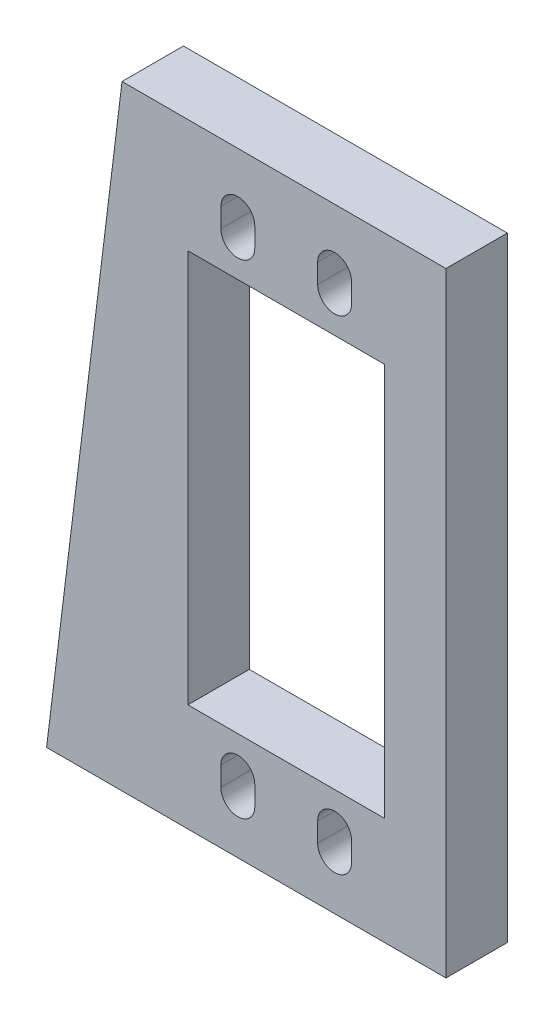
ISO-10303-21;
HEADER;
FILE_DESCRIPTION(('STEP AP214'),'2;1');
FILE_NAME('part.step','',(''),(''),'','','');
FILE_SCHEMA(('AUTOMOTIVE_DESIGN { 1 0 10303 214 1 1 1 1 }'));
ENDSEC;
DATA;
#1=APPLICATION_CONTEXT('core data for automotive mechanical design processes');
#2=APPLICATION_PROTOCOL_DEFINITION('international standard','automotive_design',2000,#1);
#3=PRODUCT_CONTEXT('',#1,'mechanical');
#4=PRODUCT('Part','Part','',(#3));
#5=PRODUCT_RELATED_PRODUCT_CATEGORY('part','',(#4));
#6=PRODUCT_DEFINITION_FORMATION('','',#4);
#7=PRODUCT_DEFINITION_CONTEXT('part definition',#1,'design');
#8=PRODUCT_DEFINITION('design','',#6,#7);
#9=PRODUCT_DEFINITION_SHAPE('','',#8);
#10=(LENGTH_UNIT() NAMED_UNIT(*) SI_UNIT(.MILLI.,.METRE.));
#11=(NAMED_UNIT(*) PLANE_ANGLE_UNIT() SI_UNIT($,.RADIAN.));
#12=(NAMED_UNIT(*) SI_UNIT($,.STERADIAN.) SOLID_ANGLE_UNIT());
#13=UNCERTAINTY_MEASURE_WITH_UNIT(LENGTH_MEASURE(1.E-05),#10,'distance_accuracy_value','');
#14=(GEOMETRIC_REPRESENTATION_CONTEXT(3) GLOBAL_UNCERTAINTY_ASSIGNED_CONTEXT((#13)) GLOBAL_UNIT_ASSIGNED_CONTEXT((#10,
#11,#12)) REPRESENTATION_CONTEXT('',''));
#15=CARTESIAN_POINT('',(0.,0.,0.));
#16=DIRECTION('',(0.,0.,1.));
#17=DIRECTION('',(1.,0.,0.));
#18=AXIS2_PLACEMENT_3D('',#15,#16,#17);
#19=CARTESIAN_POINT('',(34.9250000000002,1.31188462870747E-13,6.35));
#20=DIRECTION('',(1.,0.,0.));
#21=DIRECTION('',(0.,1.,0.));
#22=AXIS2_PLACEMENT_3D('',#19,#20,#21);
#23=PLANE('',#22);
#24=DIRECTION('',(0.,-1.,0.));
#25=VECTOR('',#24,1.);
#26=CARTESIAN_POINT('',(34.9250000000002,1.31188462870747E-13,0.));
#27=LINE('',#26,#25);
#28=CARTESIAN_POINT('',(34.925,51.7525,0.));
#29=VERTEX_POINT('',#28);
#30=CARTESIAN_POINT('',(34.9250000000002,11.1125,0.));
#31=VERTEX_POINT('',#30);
#32=EDGE_CURVE('E289',#29,#31,#27,.T.);
#33=ORIENTED_EDGE('',*,*,#32,.T.);
#34=DIRECTION('',(0.,0.,-1.));
#35=VECTOR('',#34,1.);
#36=CARTESIAN_POINT('',(34.9250000000002,11.1125,6.35));
#37=LINE('',#36,#35);
#38=CARTESIAN_POINT('',(34.9250000000002,11.1125,6.35));
#39=VERTEX_POINT('',#38);
#40=EDGE_CURVE('E11',#39,#31,#37,.T.);
#41=ORIENTED_EDGE('',*,*,#40,.F.);
#42=DIRECTION('',(0.,-1.,0.));
#43=VECTOR('',#42,1.);
#44=CARTESIAN_POINT('',(34.9250000000002,1.31188462870747E-13,6.35));
#45=LINE('',#44,#43);
#46=CARTESIAN_POINT('',(34.925,51.7525,6.35));
#47=VERTEX_POINT('',#46);
#48=EDGE_CURVE('E212',#47,#39,#45,.T.);
#49=ORIENTED_EDGE('',*,*,#48,.F.);
#50=DIRECTION('',(0.,0.,-1.));
#51=VECTOR('',#50,1.);
#52=CARTESIAN_POINT('',(34.925,51.7525,6.35));
#53=LINE('',#52,#51);
#54=EDGE_CURVE('E56',#47,#29,#53,.T.);
#55=ORIENTED_EDGE('',*,*,#54,.T.);
#56=EDGE_LOOP('',(#33,#41,#49,#55));
#57=FACE_BOUND('',#56,.T.);
#58=ADVANCED_FACE('F37',(#57),#23,.F.);
#59=CARTESIAN_POINT('',(0.,11.1124999999999,6.35));
#60=DIRECTION('',(0.,-1.,0.));
#61=DIRECTION('',(1.,0.,0.));
#62=AXIS2_PLACEMENT_3D('',#59,#60,#61);
#63=PLANE('',#62);
#64=DIRECTION('',(-1.,0.,0.));
#65=VECTOR('',#64,1.);
#66=CARTESIAN_POINT('',(0.,11.1124999999999,0.));
#67=LINE('',#66,#65);
#68=CARTESIAN_POINT('',(14.6050000000002,11.1124999999999,0.));
#69=VERTEX_POINT('',#68);
#70=EDGE_CURVE('E218',#31,#69,#67,.T.);
#71=ORIENTED_EDGE('',*,*,#70,.T.);
#72=DIRECTION('',(0.,0.,-1.));
#73=VECTOR('',#72,1.);
#74=CARTESIAN_POINT('',(14.6050000000002,11.1124999999999,6.35));
#75=LINE('',#74,#73);
#76=CARTESIAN_POINT('',(14.6050000000002,11.1124999999999,6.35));
#77=VERTEX_POINT('',#76);
#78=EDGE_CURVE('E47',#77,#69,#75,.T.);
#79=ORIENTED_EDGE('',*,*,#78,.F.);
#80=DIRECTION('',(-1.,0.,0.));
#81=VECTOR('',#80,1.);
#82=CARTESIAN_POINT('',(0.,11.1124999999999,6.35));
#83=LINE('',#82,#81);
#84=EDGE_CURVE('E206',#39,#77,#83,.T.);
#85=ORIENTED_EDGE('',*,*,#84,.F.);
#86=ORIENTED_EDGE('',*,*,#40,.T.);
#87=EDGE_LOOP('',(#71,#79,#85,#86));
#88=FACE_BOUND('',#87,.T.);
#89=ADVANCED_FACE('F217',(#88),#63,.F.);
#90=CARTESIAN_POINT('',(14.6050000000002,0.,6.35));
#91=DIRECTION('',(1.,0.,0.));
#92=DIRECTION('',(0.,1.,0.));
#93=AXIS2_PLACEMENT_3D('',#90,#91,#92);
#94=PLANE('',#93);
#95=DIRECTION('',(0.,-1.,0.));
#96=VECTOR('',#95,1.);
#97=CARTESIAN_POINT('',(14.6050000000002,0.,0.));
#98=LINE('',#97,#96);
#99=CARTESIAN_POINT('',(14.605,51.7524999999999,0.));
#100=VERTEX_POINT('',#99);
#101=EDGE_CURVE('E292',#100,#69,#98,.T.);
#102=ORIENTED_EDGE('',*,*,#101,.F.);
#103=DIRECTION('',(0.,0.,-1.));
#104=VECTOR('',#103,1.);
#105=CARTESIAN_POINT('',(14.605,51.7524999999999,6.35));
#106=LINE('',#105,#104);
#107=CARTESIAN_POINT('',(14.605,51.7524999999999,6.35));
#108=VERTEX_POINT('',#107);
#109=EDGE_CURVE('E130',#108,#100,#106,.T.);
#110=ORIENTED_EDGE('',*,*,#109,.F.);
#111=DIRECTION('',(0.,-1.,0.));
#112=VECTOR('',#111,1.);
#113=CARTESIAN_POINT('',(14.6050000000002,0.,6.35));
#114=LINE('',#113,#112);
#115=EDGE_CURVE('E211',#108,#77,#114,.T.);
#116=ORIENTED_EDGE('',*,*,#115,.T.);
#117=ORIENTED_EDGE('',*,*,#78,.T.);
#118=EDGE_LOOP('',(#102,#110,#116,#117));
#119=FACE_BOUND('',#118,.T.);
#120=ADVANCED_FACE('F222',(#119),#94,.T.);
#121=CARTESIAN_POINT('',(0.,0.,6.35));
#122=DIRECTION('',(0.,1.,0.));
#123=DIRECTION('',(0.,0.,1.));
#124=AXIS2_PLACEMENT_3D('',#121,#122,#123);
#125=PLANE('',#124);
#126=DIRECTION('',(1.,0.,0.));
#127=VECTOR('',#126,1.);
#128=CARTESIAN_POINT('',(0.,0.,0.));
#129=LINE('',#128,#127);
#130=CARTESIAN_POINT('',(0.,0.,0.));
#131=VERTEX_POINT('',#130);
#132=CARTESIAN_POINT('',(41.275,0.,0.));
#133=VERTEX_POINT('',#132);
#134=EDGE_CURVE('E277',#131,#133,#129,.T.);
#135=ORIENTED_EDGE('',*,*,#134,.T.);
#136=DIRECTION('',(0.,0.,-1.));
#137=VECTOR('',#136,1.);
#138=CARTESIAN_POINT('',(41.275,0.,6.35));
#139=LINE('',#138,#137);
#140=CARTESIAN_POINT('',(41.275,0.,6.35));
#141=VERTEX_POINT('',#140);
#142=EDGE_CURVE('E299',#141,#133,#139,.T.);
#143=ORIENTED_EDGE('',*,*,#142,.F.);
#144=DIRECTION('',(1.,0.,0.));
#145=VECTOR('',#144,1.);
#146=CARTESIAN_POINT('',(0.,0.,6.35));
#147=LINE('',#146,#145);
#148=CARTESIAN_POINT('',(0.,0.,6.35));
#149=VERTEX_POINT('',#148);
#150=EDGE_CURVE('E397',#149,#141,#147,.T.);
#151=ORIENTED_EDGE('',*,*,#150,.F.);
#152=DIRECTION('',(0.,0.,-1.));
#153=VECTOR('',#152,1.);
#154=CARTESIAN_POINT('',(0.,0.,6.35));
#155=LINE('',#154,#153);
#156=EDGE_CURVE('E301',#149,#131,#155,.T.);
#157=ORIENTED_EDGE('',*,*,#156,.T.);
#158=EDGE_LOOP('',(#135,#143,#151,#157));
#159=FACE_BOUND('',#158,.T.);
#160=ADVANCED_FACE('F423',(#159),#125,.F.);
#161=CARTESIAN_POINT('',(41.275,0.,6.35));
#162=DIRECTION('',(-1.,0.,0.));
#163=DIRECTION('',(0.,0.,1.));
#164=AXIS2_PLACEMENT_3D('',#161,#162,#163);
#165=PLANE('',#164);
#166=DIRECTION('',(0.,1.,0.));
#167=VECTOR('',#166,1.);
#168=CARTESIAN_POINT('',(41.275,0.,0.));
#169=LINE('',#168,#167);
#170=CARTESIAN_POINT('',(41.275,63.5,0.));
#171=VERTEX_POINT('',#170);
#172=EDGE_CURVE('E280',#133,#171,#169,.T.);
#173=ORIENTED_EDGE('',*,*,#172,.T.);
#174=DIRECTION('',(0.,0.,-1.));
#175=VECTOR('',#174,1.);
#176=CARTESIAN_POINT('',(41.275,63.5,6.35));
#177=LINE('',#176,#175);
#178=CARTESIAN_POINT('',(41.275,63.5,6.35));
#179=VERTEX_POINT('',#178);
#180=EDGE_CURVE('E306',#179,#171,#177,.T.);
#181=ORIENTED_EDGE('',*,*,#180,.F.);
#182=DIRECTION('',(0.,1.,0.));
#183=VECTOR('',#182,1.);
#184=CARTESIAN_POINT('',(41.275,0.,6.35));
#185=LINE('',#184,#183);
#186=EDGE_CURVE('E400',#141,#179,#185,.T.);
#187=ORIENTED_EDGE('',*,*,#186,.F.);
#188=ORIENTED_EDGE('',*,*,#142,.T.);
#189=EDGE_LOOP('',(#173,#181,#187,#188));
#190=FACE_BOUND('',#189,.T.);
#191=ADVANCED_FACE('F425',(#190),#165,.F.);
#192=CARTESIAN_POINT('',(0.,63.5,6.35));
#193=DIRECTION('',(0.,1.,0.));
#194=DIRECTION('',(0.,0.,1.));
#195=AXIS2_PLACEMENT_3D('',#192,#193,#194);
#196=PLANE('',#195);
#197=DIRECTION('',(1.,0.,0.));
#198=VECTOR('',#197,1.);
#199=CARTESIAN_POINT('',(0.,63.5,0.));
#200=LINE('',#199,#198);
#201=CARTESIAN_POINT('',(7.79681961733423,63.5,0.));
#202=VERTEX_POINT('',#201);
#203=EDGE_CURVE('E283',#202,#171,#200,.T.);
#204=ORIENTED_EDGE('',*,*,#203,.F.);
#205=DIRECTION('',(0.,0.,-1.));
#206=VECTOR('',#205,1.);
#207=CARTESIAN_POINT('',(7.79681961733423,63.5,6.35));
#208=LINE('',#207,#206);
#209=CARTESIAN_POINT('',(7.79681961733423,63.5,6.35));
#210=VERTEX_POINT('',#209);
#211=EDGE_CURVE('E303',#210,#202,#208,.T.);
#212=ORIENTED_EDGE('',*,*,#211,.F.);
#213=DIRECTION('',(1.,0.,0.));
#214=VECTOR('',#213,1.);
#215=CARTESIAN_POINT('',(0.,63.5,6.35));
#216=LINE('',#215,#214);
#217=EDGE_CURVE('E402',#210,#179,#216,.T.);
#218=ORIENTED_EDGE('',*,*,#217,.T.);
#219=ORIENTED_EDGE('',*,*,#180,.T.);
#220=EDGE_LOOP('',(#204,#212,#218,#219));
#221=FACE_BOUND('',#220,.T.);
#222=ADVANCED_FACE('F418',(#221),#196,.T.);
#223=CARTESIAN_POINT('',(19.765,57.4324999999999,6.35));
#224=DIRECTION('',(0.,0.,-1.));
#225=DIRECTION('',(-1.,0.,0.));
#226=AXIS2_PLACEMENT_3D('',#223,#224,#225);
#227=CYLINDRICAL_SURFACE('',#226,1.75000000000001);
#228=CARTESIAN_POINT('',(19.765,57.4324999999999,0.));
#229=DIRECTION('',(0.,0.,1.));
#230=DIRECTION('',(1.,0.,0.));
#231=AXIS2_PLACEMENT_3D('',#228,#229,#230);
#232=CIRCLE('',#231,1.75000000000001);
#233=CARTESIAN_POINT('',(21.515,57.4324999999999,0.));
#234=VERTEX_POINT('',#233);
#235=CARTESIAN_POINT('',(18.015,57.4324999999999,0.));
#236=VERTEX_POINT('',#235);
#237=EDGE_CURVE('E265',#234,#236,#232,.T.);
#238=ORIENTED_EDGE('',*,*,#237,.F.);
#239=DIRECTION('',(0.,0.,-1.));
#240=VECTOR('',#239,1.);
#241=CARTESIAN_POINT('',(21.515,57.4324999999999,6.35));
#242=LINE('',#241,#240);
#243=CARTESIAN_POINT('',(21.515,57.4324999999999,6.35));
#244=VERTEX_POINT('',#243);
#245=EDGE_CURVE('E304',#244,#234,#242,.T.);
#246=ORIENTED_EDGE('',*,*,#245,.F.);
#247=CARTESIAN_POINT('',(19.765,57.4324999999999,6.35));
#248=DIRECTION('',(0.,0.,1.));
#249=DIRECTION('',(1.,0.,0.));
#250=AXIS2_PLACEMENT_3D('',#247,#248,#249);
#251=CIRCLE('',#250,1.75000000000001);
#252=CARTESIAN_POINT('',(18.015,57.4324999999999,6.35));
#253=VERTEX_POINT('',#252);
#254=EDGE_CURVE('E386',#244,#253,#251,.T.);
#255=ORIENTED_EDGE('',*,*,#254,.T.);
#256=DIRECTION('',(0.,0.,-1.));
#257=VECTOR('',#256,1.);
#258=CARTESIAN_POINT('',(18.015,57.4324999999999,6.35));
#259=LINE('',#258,#257);
#260=EDGE_CURVE('E310',#253,#236,#259,.T.);
#261=ORIENTED_EDGE('',*,*,#260,.T.);
#262=EDGE_LOOP('',(#238,#246,#255,#261));
#263=FACE_BOUND('',#262,.T.);
#264=ADVANCED_FACE('F432',(#263),#227,.F.);
#265=CARTESIAN_POINT('',(21.5150000000004,1.49290302342567E-13,6.35));
#266=DIRECTION('',(-1.,0.,0.));
#267=DIRECTION('',(0.,-1.,0.));
#268=AXIS2_PLACEMENT_3D('',#265,#266,#267);
#269=PLANE('',#268);
#270=DIRECTION('',(0.,1.,0.));
#271=VECTOR('',#270,1.);
#272=CARTESIAN_POINT('',(21.5150000000004,1.49290302342567E-13,0.));
#273=LINE('',#272,#271);
#274=CARTESIAN_POINT('',(21.515,55.4324999999999,0.));
#275=VERTEX_POINT('',#274);
#276=EDGE_CURVE('E268',#275,#234,#273,.T.);
#277=ORIENTED_EDGE('',*,*,#276,.F.);
#278=DIRECTION('',(0.,0.,-1.));
#279=VECTOR('',#278,1.);
#280=CARTESIAN_POINT('',(21.515,55.4324999999999,6.35));
#281=LINE('',#280,#279);
#282=CARTESIAN_POINT('',(21.515,55.4324999999999,6.35));
#283=VERTEX_POINT('',#282);
#284=EDGE_CURVE('E315',#283,#275,#281,.T.);
#285=ORIENTED_EDGE('',*,*,#284,.F.);
#286=DIRECTION('',(0.,1.,0.));
#287=VECTOR('',#286,1.);
#288=CARTESIAN_POINT('',(21.5150000000004,1.49290302342567E-13,6.35));
#289=LINE('',#288,#287);
#290=EDGE_CURVE('E389',#283,#244,#289,.T.);
#291=ORIENTED_EDGE('',*,*,#290,.T.);
#292=ORIENTED_EDGE('',*,*,#245,.T.);
#293=EDGE_LOOP('',(#277,#285,#291,#292));
#294=FACE_BOUND('',#293,.T.);
#295=ADVANCED_FACE('F494',(#294),#269,.T.);
#296=CARTESIAN_POINT('',(19.765,55.4324999999999,6.35));
#297=DIRECTION('',(0.,0.,-1.));
#298=DIRECTION('',(-1.,0.,0.));
#299=AXIS2_PLACEMENT_3D('',#296,#297,#298);
#300=CYLINDRICAL_SURFACE('',#299,1.75000000000001);
#301=CARTESIAN_POINT('',(19.765,55.4324999999999,0.));
#302=DIRECTION('',(0.,0.,1.));
#303=DIRECTION('',(1.,0.,0.));
#304=AXIS2_PLACEMENT_3D('',#301,#302,#303);
#305=CIRCLE('',#304,1.75000000000001);
#306=CARTESIAN_POINT('',(18.015,55.4324999999999,0.));
#307=VERTEX_POINT('',#306);
#308=EDGE_CURVE('E271',#307,#275,#305,.T.);
#309=ORIENTED_EDGE('',*,*,#308,.F.);
#310=DIRECTION('',(0.,0.,-1.));
#311=VECTOR('',#310,1.);
#312=CARTESIAN_POINT('',(18.015,55.4324999999999,6.35));
#313=LINE('',#312,#311);
#314=CARTESIAN_POINT('',(18.015,55.4324999999999,6.35));
#315=VERTEX_POINT('',#314);
#316=EDGE_CURVE('E312',#315,#307,#313,.T.);
#317=ORIENTED_EDGE('',*,*,#316,.F.);
#318=CARTESIAN_POINT('',(19.765,55.4324999999999,6.35));
#319=DIRECTION('',(0.,0.,1.));
#320=DIRECTION('',(1.,0.,0.));
#321=AXIS2_PLACEMENT_3D('',#318,#319,#320);
#322=CIRCLE('',#321,1.75000000000001);
#323=EDGE_CURVE('E392',#315,#283,#322,.T.);
#324=ORIENTED_EDGE('',*,*,#323,.T.);
#325=ORIENTED_EDGE('',*,*,#284,.T.);
#326=EDGE_LOOP('',(#309,#317,#324,#325));
#327=FACE_BOUND('',#326,.T.);
#328=ADVANCED_FACE('F481',(#327),#300,.F.);
#329=CARTESIAN_POINT('',(29.765,57.4324999999999,6.35));
#330=DIRECTION('',(0.,0.,-1.));
#331=DIRECTION('',(-1.,0.,0.));
#332=AXIS2_PLACEMENT_3D('',#329,#330,#331);
#333=CYLINDRICAL_SURFACE('',#332,1.75);
#334=CARTESIAN_POINT('',(29.765,57.4324999999999,0.));
#335=DIRECTION('',(0.,0.,1.));
#336=DIRECTION('',(1.,0.,0.));
#337=AXIS2_PLACEMENT_3D('',#334,#335,#336);
#338=CIRCLE('',#337,1.75);
#339=CARTESIAN_POINT('',(31.515,57.4325,0.));
#340=VERTEX_POINT('',#339);
#341=CARTESIAN_POINT('',(28.015,57.4324999999999,0.));
#342=VERTEX_POINT('',#341);
#343=EDGE_CURVE('E253',#340,#342,#338,.T.);
#344=ORIENTED_EDGE('',*,*,#343,.F.);
#345=DIRECTION('',(0.,0.,-1.));
#346=VECTOR('',#345,1.);
#347=CARTESIAN_POINT('',(31.515,57.4325,6.35));
#348=LINE('',#347,#346);
#349=CARTESIAN_POINT('',(31.515,57.4325,6.35));
#350=VERTEX_POINT('',#349);
#351=EDGE_CURVE('E313',#350,#340,#348,.T.);
#352=ORIENTED_EDGE('',*,*,#351,.F.);
#353=CARTESIAN_POINT('',(29.765,57.4324999999999,6.35));
#354=DIRECTION('',(0.,0.,1.));
#355=DIRECTION('',(1.,0.,0.));
#356=AXIS2_PLACEMENT_3D('',#353,#354,#355);
#357=CIRCLE('',#356,1.75);
#358=CARTESIAN_POINT('',(28.015,57.4324999999999,6.35));
#359=VERTEX_POINT('',#358);
#360=EDGE_CURVE('E375',#350,#359,#357,.T.);
#361=ORIENTED_EDGE('',*,*,#360,.T.);
#362=DIRECTION('',(0.,0.,-1.));
#363=VECTOR('',#362,1.);
#364=CARTESIAN_POINT('',(28.015,57.4324999999999,6.35));
#365=LINE('',#364,#363);
#366=EDGE_CURVE('E318',#359,#342,#365,.T.);
#367=ORIENTED_EDGE('',*,*,#366,.T.);
#368=EDGE_LOOP('',(#344,#352,#361,#367));
#369=FACE_BOUND('',#368,.T.);
#370=ADVANCED_FACE('F477',(#369),#333,.F.);
#371=CARTESIAN_POINT('',(31.5150000000004,2.18679241381639E-13,6.35));
#372=DIRECTION('',(-1.,0.,0.));
#373=DIRECTION('',(0.,-1.,0.));
#374=AXIS2_PLACEMENT_3D('',#371,#372,#373);
#375=PLANE('',#374);
#376=DIRECTION('',(0.,1.,0.));
#377=VECTOR('',#376,1.);
#378=CARTESIAN_POINT('',(31.5150000000004,2.18679241381639E-13,0.));
#379=LINE('',#378,#377);
#380=CARTESIAN_POINT('',(31.515,55.4325,0.));
#381=VERTEX_POINT('',#380);
#382=EDGE_CURVE('E256',#381,#340,#379,.T.);
#383=ORIENTED_EDGE('',*,*,#382,.F.);
#384=DIRECTION('',(0.,0.,-1.));
#385=VECTOR('',#384,1.);
#386=CARTESIAN_POINT('',(31.515,55.4325,6.35));
#387=LINE('',#386,#385);
#388=CARTESIAN_POINT('',(31.515,55.4325,6.35));
#389=VERTEX_POINT('',#388);
#390=EDGE_CURVE('E323',#389,#381,#387,.T.);
#391=ORIENTED_EDGE('',*,*,#390,.F.);
#392=DIRECTION('',(0.,1.,0.));
#393=VECTOR('',#392,1.);
#394=CARTESIAN_POINT('',(31.5150000000004,2.18679241381639E-13,6.35));
#395=LINE('',#394,#393);
#396=EDGE_CURVE('E378',#389,#350,#395,.T.);
#397=ORIENTED_EDGE('',*,*,#396,.T.);
#398=ORIENTED_EDGE('',*,*,#351,.T.);
#399=EDGE_LOOP('',(#383,#391,#397,#398));
#400=FACE_BOUND('',#399,.T.);
#401=ADVANCED_FACE('F480',(#400),#375,.T.);
#402=CARTESIAN_POINT('',(29.765,55.4324999999999,6.35));
#403=DIRECTION('',(0.,0.,-1.));
#404=DIRECTION('',(-1.,0.,0.));
#405=AXIS2_PLACEMENT_3D('',#402,#403,#404);
#406=CYLINDRICAL_SURFACE('',#405,1.75);
#407=CARTESIAN_POINT('',(29.765,55.4324999999999,0.));
#408=DIRECTION('',(0.,0.,1.));
#409=DIRECTION('',(1.,0.,0.));
#410=AXIS2_PLACEMENT_3D('',#407,#408,#409);
#411=CIRCLE('',#410,1.75);
#412=CARTESIAN_POINT('',(28.015,55.4324999999999,0.));
#413=VERTEX_POINT('',#412);
#414=EDGE_CURVE('E259',#413,#381,#411,.T.);
#415=ORIENTED_EDGE('',*,*,#414,.F.);
#416=DIRECTION('',(0.,0.,-1.));
#417=VECTOR('',#416,1.);
#418=CARTESIAN_POINT('',(28.015,55.4324999999999,6.35));
#419=LINE('',#418,#417);
#420=CARTESIAN_POINT('',(28.015,55.4324999999999,6.35));
#421=VERTEX_POINT('',#420);
#422=EDGE_CURVE('E320',#421,#413,#419,.T.);
#423=ORIENTED_EDGE('',*,*,#422,.F.);
#424=CARTESIAN_POINT('',(29.765,55.4324999999999,6.35));
#425=DIRECTION('',(0.,0.,1.));
#426=DIRECTION('',(1.,0.,0.));
#427=AXIS2_PLACEMENT_3D('',#424,#425,#426);
#428=CIRCLE('',#427,1.75);
#429=EDGE_CURVE('E381',#421,#389,#428,.T.);
#430=ORIENTED_EDGE('',*,*,#429,.T.);
#431=ORIENTED_EDGE('',*,*,#390,.T.);
#432=EDGE_LOOP('',(#415,#423,#430,#431));
#433=FACE_BOUND('',#432,.T.);
#434=ADVANCED_FACE('F465',(#433),#406,.F.);
#435=CARTESIAN_POINT('',(19.7650000000002,5.43249999999991,6.35));
#436=DIRECTION('',(0.,0.,-1.));
#437=DIRECTION('',(-1.,0.,0.));
#438=AXIS2_PLACEMENT_3D('',#435,#436,#437);
#439=CYLINDRICAL_SURFACE('',#438,1.74999999999999);
#440=CARTESIAN_POINT('',(19.7650000000002,5.43249999999991,0.));
#441=DIRECTION('',(0.,0.,1.));
#442=DIRECTION('',(1.,0.,0.));
#443=AXIS2_PLACEMENT_3D('',#440,#441,#442);
#444=CIRCLE('',#443,1.74999999999999);
#445=CARTESIAN_POINT('',(18.0150000000002,5.43249999999991,0.));
#446=VERTEX_POINT('',#445);
#447=CARTESIAN_POINT('',(21.5150000000002,5.43249999999992,0.));
#448=VERTEX_POINT('',#447);
#449=EDGE_CURVE('E241',#446,#448,#444,.T.);
#450=ORIENTED_EDGE('',*,*,#449,.F.);
#451=DIRECTION('',(0.,0.,-1.));
#452=VECTOR('',#451,1.);
#453=CARTESIAN_POINT('',(18.0150000000002,5.43249999999991,6.35));
#454=LINE('',#453,#452);
#455=CARTESIAN_POINT('',(18.0150000000002,5.43249999999991,6.35));
#456=VERTEX_POINT('',#455);
#457=EDGE_CURVE('E321',#456,#446,#454,.T.);
#458=ORIENTED_EDGE('',*,*,#457,.F.);
#459=CARTESIAN_POINT('',(19.7650000000002,5.43249999999991,6.35));
#460=DIRECTION('',(0.,0.,1.));
#461=DIRECTION('',(1.,0.,0.));
#462=AXIS2_PLACEMENT_3D('',#459,#460,#461);
#463=CIRCLE('',#462,1.74999999999999);
#464=CARTESIAN_POINT('',(21.5150000000002,5.43249999999992,6.35));
#465=VERTEX_POINT('',#464);
#466=EDGE_CURVE('E358',#456,#465,#463,.T.);
#467=ORIENTED_EDGE('',*,*,#466,.T.);
#468=DIRECTION('',(0.,0.,-1.));
#469=VECTOR('',#468,1.);
#470=CARTESIAN_POINT('',(21.5150000000002,5.43249999999992,6.35));
#471=LINE('',#470,#469);
#472=EDGE_CURVE('E326',#465,#448,#471,.T.);
#473=ORIENTED_EDGE('',*,*,#472,.T.);
#474=EDGE_LOOP('',(#450,#458,#467,#473));
#475=FACE_BOUND('',#474,.T.);
#476=ADVANCED_FACE('F461',(#475),#439,.F.);
#477=CARTESIAN_POINT('',(18.0150000000002,0.,6.35));
#478=DIRECTION('',(1.,0.,0.));
#479=DIRECTION('',(0.,0.,-1.));
#480=AXIS2_PLACEMENT_3D('',#477,#478,#479);
#481=PLANE('',#480);
#482=DIRECTION('',(0.,-1.,0.));
#483=VECTOR('',#482,1.);
#484=CARTESIAN_POINT('',(18.0150000000002,0.,0.));
#485=LINE('',#484,#483);
#486=CARTESIAN_POINT('',(18.0150000000002,7.43249999999991,0.));
#487=VERTEX_POINT('',#486);
#488=EDGE_CURVE('E244',#487,#446,#485,.T.);
#489=ORIENTED_EDGE('',*,*,#488,.F.);
#490=DIRECTION('',(0.,0.,-1.));
#491=VECTOR('',#490,1.);
#492=CARTESIAN_POINT('',(18.0150000000002,7.43249999999991,6.35));
#493=LINE('',#492,#491);
#494=CARTESIAN_POINT('',(18.0150000000002,7.43249999999991,6.35));
#495=VERTEX_POINT('',#494);
#496=EDGE_CURVE('E330',#495,#487,#493,.T.);
#497=ORIENTED_EDGE('',*,*,#496,.F.);
#498=DIRECTION('',(0.,-1.,0.));
#499=VECTOR('',#498,1.);
#500=CARTESIAN_POINT('',(18.0150000000002,0.,6.35));
#501=LINE('',#500,#499);
#502=EDGE_CURVE('E367',#495,#456,#501,.T.);
#503=ORIENTED_EDGE('',*,*,#502,.T.);
#504=ORIENTED_EDGE('',*,*,#457,.T.);
#505=EDGE_LOOP('',(#489,#497,#503,#504));
#506=FACE_BOUND('',#505,.T.);
#507=ADVANCED_FACE('F464',(#506),#481,.T.);
#508=CARTESIAN_POINT('',(19.7650000000002,7.43249999999991,6.35));
#509=DIRECTION('',(0.,0.,-1.));
#510=DIRECTION('',(-1.,0.,0.));
#511=AXIS2_PLACEMENT_3D('',#508,#509,#510);
#512=CYLINDRICAL_SURFACE('',#511,1.74999999999999);
#513=CARTESIAN_POINT('',(19.7650000000002,7.43249999999991,0.));
#514=DIRECTION('',(0.,0.,1.));
#515=DIRECTION('',(1.,0.,0.));
#516=AXIS2_PLACEMENT_3D('',#513,#514,#515);
#517=CIRCLE('',#516,1.74999999999999);
#518=CARTESIAN_POINT('',(21.5150000000002,7.43249999999993,0.));
#519=VERTEX_POINT('',#518);
#520=EDGE_CURVE('E247',#519,#487,#517,.T.);
#521=ORIENTED_EDGE('',*,*,#520,.F.);
#522=DIRECTION('',(0.,0.,-1.));
#523=VECTOR('',#522,1.);
#524=CARTESIAN_POINT('',(21.5150000000002,7.43249999999993,6.35));
#525=LINE('',#524,#523);
#526=CARTESIAN_POINT('',(21.5150000000002,7.43249999999993,6.35));
#527=VERTEX_POINT('',#526);
#528=EDGE_CURVE('E328',#527,#519,#525,.T.);
#529=ORIENTED_EDGE('',*,*,#528,.F.);
#530=CARTESIAN_POINT('',(19.7650000000002,7.43249999999991,6.35));
#531=DIRECTION('',(0.,0.,1.));
#532=DIRECTION('',(1.,0.,0.));
#533=AXIS2_PLACEMENT_3D('',#530,#531,#532);
#534=CIRCLE('',#533,1.74999999999999);
#535=EDGE_CURVE('E370',#527,#495,#534,.T.);
#536=ORIENTED_EDGE('',*,*,#535,.T.);
#537=ORIENTED_EDGE('',*,*,#496,.T.);
#538=EDGE_LOOP('',(#521,#529,#536,#537));
#539=FACE_BOUND('',#538,.T.);
#540=ADVANCED_FACE('F469',(#539),#512,.F.);
#541=CARTESIAN_POINT('',(29.7650000000002,5.43249999999995,6.35));
#542=DIRECTION('',(0.,0.,-1.));
#543=DIRECTION('',(-1.,0.,0.));
#544=AXIS2_PLACEMENT_3D('',#541,#542,#543);
#545=CYLINDRICAL_SURFACE('',#544,1.74999999999999);
#546=CARTESIAN_POINT('',(29.7650000000002,5.43249999999995,0.));
#547=DIRECTION('',(0.,0.,1.));
#548=DIRECTION('',(1.,0.,0.));
#549=AXIS2_PLACEMENT_3D('',#546,#547,#548);
#550=CIRCLE('',#549,1.74999999999999);
#551=CARTESIAN_POINT('',(28.0150000000002,5.43249999999994,0.));
#552=VERTEX_POINT('',#551);
#553=CARTESIAN_POINT('',(31.5150000000002,5.43249999999995,0.));
#554=VERTEX_POINT('',#553);
#555=EDGE_CURVE('E229',#552,#554,#550,.T.);
#556=ORIENTED_EDGE('',*,*,#555,.F.);
#557=DIRECTION('',(0.,0.,-1.));
#558=VECTOR('',#557,1.);
#559=CARTESIAN_POINT('',(28.0150000000002,5.43249999999994,6.35));
#560=LINE('',#559,#558);
#561=CARTESIAN_POINT('',(28.0150000000002,5.43249999999994,6.35));
#562=VERTEX_POINT('',#561);
#563=EDGE_CURVE('E41',#562,#552,#560,.T.);
#564=ORIENTED_EDGE('',*,*,#563,.F.);
#565=CARTESIAN_POINT('',(29.7650000000002,5.43249999999995,6.35));
#566=DIRECTION('',(0.,0.,1.));
#567=DIRECTION('',(1.,0.,0.));
#568=AXIS2_PLACEMENT_3D('',#565,#566,#567);
#569=CIRCLE('',#568,1.74999999999999);
#570=CARTESIAN_POINT('',(31.5150000000002,5.43249999999995,6.35));
#571=VERTEX_POINT('',#570);
#572=EDGE_CURVE('E297',#562,#571,#569,.T.);
#573=ORIENTED_EDGE('',*,*,#572,.T.);
#574=DIRECTION('',(0.,0.,-1.));
#575=VECTOR('',#574,1.);
#576=CARTESIAN_POINT('',(31.5150000000002,5.43249999999995,6.35));
#577=LINE('',#576,#575);
#578=EDGE_CURVE('E225',#571,#554,#577,.T.);
#579=ORIENTED_EDGE('',*,*,#578,.T.);
#580=EDGE_LOOP('',(#556,#564,#573,#579));
#581=FACE_BOUND('',#580,.T.);
#582=ADVANCED_FACE('F39',(#581),#545,.F.);
#583=CARTESIAN_POINT('',(28.0150000000002,1.94393112717962E-13,6.35));
#584=DIRECTION('',(1.,0.,0.));
#585=DIRECTION('',(0.,1.,0.));
#586=AXIS2_PLACEMENT_3D('',#583,#584,#585);
#587=PLANE('',#586);
#588=DIRECTION('',(0.,-1.,0.));
#589=VECTOR('',#588,1.);
#590=CARTESIAN_POINT('',(28.0150000000002,1.94393112717962E-13,0.));
#591=LINE('',#590,#589);
#592=CARTESIAN_POINT('',(28.0150000000002,7.43249999999994,0.));
#593=VERTEX_POINT('',#592);
#594=EDGE_CURVE('E232',#593,#552,#591,.T.);
#595=ORIENTED_EDGE('',*,*,#594,.F.);
#596=DIRECTION('',(0.,0.,-1.));
#597=VECTOR('',#596,1.);
#598=CARTESIAN_POINT('',(28.0150000000002,7.43249999999994,6.35));
#599=LINE('',#598,#597);
#600=CARTESIAN_POINT('',(28.0150000000002,7.43249999999994,6.35));
#601=VERTEX_POINT('',#600);
#602=EDGE_CURVE('E335',#601,#593,#599,.T.);
#603=ORIENTED_EDGE('',*,*,#602,.F.);
#604=DIRECTION('',(0.,-1.,0.));
#605=VECTOR('',#604,1.);
#606=CARTESIAN_POINT('',(28.0150000000002,1.94393112717962E-13,6.35));
#607=LINE('',#606,#605);
#608=EDGE_CURVE('E344',#601,#562,#607,.T.);
#609=ORIENTED_EDGE('',*,*,#608,.T.);
#610=ORIENTED_EDGE('',*,*,#563,.T.);
#611=EDGE_LOOP('',(#595,#603,#609,#610));
#612=FACE_BOUND('',#611,.T.);
#613=ADVANCED_FACE('F342',(#612),#587,.T.);
#614=CARTESIAN_POINT('',(29.7650000000002,7.43249999999995,6.35));
#615=DIRECTION('',(0.,0.,-1.));
#616=DIRECTION('',(-1.,0.,0.));
#617=AXIS2_PLACEMENT_3D('',#614,#615,#616);
#618=CYLINDRICAL_SURFACE('',#617,1.75);
#619=CARTESIAN_POINT('',(29.7650000000002,7.43249999999995,0.));
#620=DIRECTION('',(0.,0.,1.));
#621=DIRECTION('',(1.,0.,0.));
#622=AXIS2_PLACEMENT_3D('',#619,#620,#621);
#623=CIRCLE('',#622,1.75);
#624=CARTESIAN_POINT('',(31.5150000000002,7.43249999999995,0.));
#625=VERTEX_POINT('',#624);
#626=EDGE_CURVE('E235',#625,#593,#623,.T.);
#627=ORIENTED_EDGE('',*,*,#626,.F.);
#628=DIRECTION('',(0.,0.,-1.));
#629=VECTOR('',#628,1.);
#630=CARTESIAN_POINT('',(31.5150000000002,7.43249999999995,6.35));
#631=LINE('',#630,#629);
#632=CARTESIAN_POINT('',(31.5150000000002,7.43249999999995,6.35));
#633=VERTEX_POINT('',#632);
#634=EDGE_CURVE('E334',#633,#625,#631,.T.);
#635=ORIENTED_EDGE('',*,*,#634,.F.);
#636=CARTESIAN_POINT('',(29.7650000000002,7.43249999999995,6.35));
#637=DIRECTION('',(0.,0.,1.));
#638=DIRECTION('',(1.,0.,0.));
#639=AXIS2_PLACEMENT_3D('',#636,#637,#638);
#640=CIRCLE('',#639,1.75);
#641=EDGE_CURVE('E353',#633,#601,#640,.T.);
#642=ORIENTED_EDGE('',*,*,#641,.T.);
#643=ORIENTED_EDGE('',*,*,#602,.T.);
#644=EDGE_LOOP('',(#627,#635,#642,#643));
#645=FACE_BOUND('',#644,.T.);
#646=ADVANCED_FACE('F350',(#645),#618,.F.);
#647=CARTESIAN_POINT('',(0.,0.,6.35));
#648=DIRECTION('',(-0.992546151641322,0.121869343405144,0.));
#649=DIRECTION('',(-0.121869343405144,-0.992546151641322,0.));
#650=AXIS2_PLACEMENT_3D('',#647,#648,#649);
#651=PLANE('',#650);
#652=DIRECTION('',(0.121869343405144,0.992546151641322,0.));
#653=VECTOR('',#652,1.);
#654=CARTESIAN_POINT('',(0.,0.,0.));
#655=LINE('',#654,#653);
#656=EDGE_CURVE('E286',#131,#202,#655,.T.);
#657=ORIENTED_EDGE('',*,*,#656,.F.);
#658=ORIENTED_EDGE('',*,*,#156,.F.);
#659=DIRECTION('',(0.121869343405144,0.992546151641322,0.));
#660=VECTOR('',#659,1.);
#661=CARTESIAN_POINT('',(0.,0.,6.35));
#662=LINE('',#661,#660);
#663=EDGE_CURVE('E405',#149,#210,#662,.T.);
#664=ORIENTED_EDGE('',*,*,#663,.T.);
#665=ORIENTED_EDGE('',*,*,#211,.T.);
#666=EDGE_LOOP('',(#657,#658,#664,#665));
#667=FACE_BOUND('',#666,.T.);
#668=ADVANCED_FACE('F410',(#667),#651,.T.);
#669=CARTESIAN_POINT('',(18.0150000000004,1.25004173678891E-13,6.35));
#670=DIRECTION('',(-1.,0.,0.));
#671=DIRECTION('',(0.,-1.,0.));
#672=AXIS2_PLACEMENT_3D('',#669,#670,#671);
#673=PLANE('',#672);
#674=DIRECTION('',(0.,1.,0.));
#675=VECTOR('',#674,1.);
#676=CARTESIAN_POINT('',(18.0150000000004,1.25004173678891E-13,0.));
#677=LINE('',#676,#675);
#678=EDGE_CURVE('E274',#307,#236,#677,.T.);
#679=ORIENTED_EDGE('',*,*,#678,.T.);
#680=ORIENTED_EDGE('',*,*,#260,.F.);
#681=DIRECTION('',(0.,1.,0.));
#682=VECTOR('',#681,1.);
#683=CARTESIAN_POINT('',(18.0150000000004,1.25004173678891E-13,6.35));
#684=LINE('',#683,#682);
#685=EDGE_CURVE('E395',#315,#253,#684,.T.);
#686=ORIENTED_EDGE('',*,*,#685,.F.);
#687=ORIENTED_EDGE('',*,*,#316,.T.);
#688=EDGE_LOOP('',(#679,#680,#686,#687));
#689=FACE_BOUND('',#688,.T.);
#690=ADVANCED_FACE('F444',(#689),#673,.F.);
#691=CARTESIAN_POINT('',(28.0150000000004,1.94393112717964E-13,6.35));
#692=DIRECTION('',(-1.,0.,0.));
#693=DIRECTION('',(0.,-1.,0.));
#694=AXIS2_PLACEMENT_3D('',#691,#692,#693);
#695=PLANE('',#694);
#696=DIRECTION('',(0.,1.,0.));
#697=VECTOR('',#696,1.);
#698=CARTESIAN_POINT('',(28.0150000000004,1.94393112717964E-13,0.));
#699=LINE('',#698,#697);
#700=EDGE_CURVE('E262',#413,#342,#699,.T.);
#701=ORIENTED_EDGE('',*,*,#700,.T.);
#702=ORIENTED_EDGE('',*,*,#366,.F.);
#703=DIRECTION('',(0.,1.,0.));
#704=VECTOR('',#703,1.);
#705=CARTESIAN_POINT('',(28.0150000000004,1.94393112717964E-13,6.35));
#706=LINE('',#705,#704);
#707=EDGE_CURVE('E384',#421,#359,#706,.T.);
#708=ORIENTED_EDGE('',*,*,#707,.F.);
#709=ORIENTED_EDGE('',*,*,#422,.T.);
#710=EDGE_LOOP('',(#701,#702,#708,#709));
#711=FACE_BOUND('',#710,.T.);
#712=ADVANCED_FACE('F449',(#711),#695,.F.);
#713=CARTESIAN_POINT('',(21.5150000000001,-1.49290302342565E-13,6.35));
#714=DIRECTION('',(1.,0.,0.));
#715=DIRECTION('',(0.,1.,0.));
#716=AXIS2_PLACEMENT_3D('',#713,#714,#715);
#717=PLANE('',#716);
#718=DIRECTION('',(0.,-1.,0.));
#719=VECTOR('',#718,1.);
#720=CARTESIAN_POINT('',(21.5150000000001,-1.49290302342565E-13,0.));
#721=LINE('',#720,#719);
#722=EDGE_CURVE('E250',#519,#448,#721,.T.);
#723=ORIENTED_EDGE('',*,*,#722,.T.);
#724=ORIENTED_EDGE('',*,*,#472,.F.);
#725=DIRECTION('',(0.,-1.,0.));
#726=VECTOR('',#725,1.);
#727=CARTESIAN_POINT('',(21.5150000000001,-1.49290302342565E-13,6.35));
#728=LINE('',#727,#726);
#729=EDGE_CURVE('E373',#527,#465,#728,.T.);
#730=ORIENTED_EDGE('',*,*,#729,.F.);
#731=ORIENTED_EDGE('',*,*,#528,.T.);
#732=EDGE_LOOP('',(#723,#724,#730,#731));
#733=FACE_BOUND('',#732,.T.);
#734=ADVANCED_FACE('F460',(#733),#717,.F.);
#735=CARTESIAN_POINT('',(31.5150000000001,-2.18679241381637E-13,6.35));
#736=DIRECTION('',(1.,0.,0.));
#737=DIRECTION('',(0.,1.,0.));
#738=AXIS2_PLACEMENT_3D('',#735,#736,#737);
#739=PLANE('',#738);
#740=DIRECTION('',(0.,-1.,0.));
#741=VECTOR('',#740,1.);
#742=CARTESIAN_POINT('',(31.5150000000001,-2.18679241381637E-13,0.));
#743=LINE('',#742,#741);
#744=EDGE_CURVE('E238',#625,#554,#743,.T.);
#745=ORIENTED_EDGE('',*,*,#744,.T.);
#746=ORIENTED_EDGE('',*,*,#578,.F.);
#747=DIRECTION('',(0.,-1.,0.));
#748=VECTOR('',#747,1.);
#749=CARTESIAN_POINT('',(31.5150000000001,-2.18679241381637E-13,6.35));
#750=LINE('',#749,#748);
#751=EDGE_CURVE('E355',#633,#571,#750,.T.);
#752=ORIENTED_EDGE('',*,*,#751,.F.);
#753=ORIENTED_EDGE('',*,*,#634,.T.);
#754=EDGE_LOOP('',(#745,#746,#752,#753));
#755=FACE_BOUND('',#754,.T.);
#756=ADVANCED_FACE('F356',(#755),#739,.F.);
#757=CARTESIAN_POINT('',(-1.76724954115137E-13,51.7524999999999,6.35));
#758=DIRECTION('',(0.,-1.,0.));
#759=DIRECTION('',(1.,0.,0.));
#760=AXIS2_PLACEMENT_3D('',#757,#758,#759);
#761=PLANE('',#760);
#762=DIRECTION('',(-1.,0.,0.));
#763=VECTOR('',#762,1.);
#764=CARTESIAN_POINT('',(-1.76724954115137E-13,51.7524999999999,0.));
#765=LINE('',#764,#763);
#766=EDGE_CURVE('E294',#29,#100,#765,.T.);
#767=ORIENTED_EDGE('',*,*,#766,.F.);
#768=ORIENTED_EDGE('',*,*,#54,.F.);
#769=DIRECTION('',(-1.,0.,0.));
#770=VECTOR('',#769,1.);
#771=CARTESIAN_POINT('',(-1.76724954115137E-13,51.7524999999999,6.35));
#772=LINE('',#771,#770);
#773=EDGE_CURVE('E223',#47,#108,#772,.T.);
#774=ORIENTED_EDGE('',*,*,#773,.T.);
#775=ORIENTED_EDGE('',*,*,#109,.T.);
#776=EDGE_LOOP('',(#767,#768,#774,#775));
#777=FACE_BOUND('',#776,.T.);
#778=ADVANCED_FACE('F459',(#777),#761,.T.);
#779=CARTESIAN_POINT('',(0.,0.,6.35));
#780=DIRECTION('',(0.,0.,1.));
#781=DIRECTION('',(1.,0.,0.));
#782=AXIS2_PLACEMENT_3D('',#779,#780,#781);
#783=PLANE('',#782);
#784=ORIENTED_EDGE('',*,*,#572,.F.);
#785=ORIENTED_EDGE('',*,*,#608,.F.);
#786=ORIENTED_EDGE('',*,*,#641,.F.);
#787=ORIENTED_EDGE('',*,*,#751,.T.);
#788=EDGE_LOOP('',(#784,#785,#786,#787));
#789=FACE_BOUND('',#788,.T.);
#790=ORIENTED_EDGE('',*,*,#466,.F.);
#791=ORIENTED_EDGE('',*,*,#502,.F.);
#792=ORIENTED_EDGE('',*,*,#535,.F.);
#793=ORIENTED_EDGE('',*,*,#729,.T.);
#794=EDGE_LOOP('',(#790,#791,#792,#793));
#795=FACE_BOUND('',#794,.T.);
#796=ORIENTED_EDGE('',*,*,#360,.F.);
#797=ORIENTED_EDGE('',*,*,#396,.F.);
#798=ORIENTED_EDGE('',*,*,#429,.F.);
#799=ORIENTED_EDGE('',*,*,#707,.T.);
#800=EDGE_LOOP('',(#796,#797,#798,#799));
#801=FACE_BOUND('',#800,.T.);
#802=ORIENTED_EDGE('',*,*,#254,.F.);
#803=ORIENTED_EDGE('',*,*,#290,.F.);
#804=ORIENTED_EDGE('',*,*,#323,.F.);
#805=ORIENTED_EDGE('',*,*,#685,.T.);
#806=EDGE_LOOP('',(#802,#803,#804,#805));
#807=FACE_BOUND('',#806,.T.);
#808=ORIENTED_EDGE('',*,*,#150,.T.);
#809=ORIENTED_EDGE('',*,*,#186,.T.);
#810=ORIENTED_EDGE('',*,*,#217,.F.);
#811=ORIENTED_EDGE('',*,*,#663,.F.);
#812=EDGE_LOOP('',(#808,#809,#810,#811));
#813=FACE_BOUND('',#812,.T.);
#814=ORIENTED_EDGE('',*,*,#48,.T.);
#815=ORIENTED_EDGE('',*,*,#84,.T.);
#816=ORIENTED_EDGE('',*,*,#115,.F.);
#817=ORIENTED_EDGE('',*,*,#773,.F.);
#818=EDGE_LOOP('',(#814,#815,#816,#817));
#819=FACE_BOUND('',#818,.T.);
#820=ADVANCED_FACE('F208',(#789,#795,#801,#807,#813,#819),#783,.T.);
#821=CARTESIAN_POINT('',(0.,0.,0.));
#822=DIRECTION('',(0.,0.,1.));
#823=DIRECTION('',(1.,0.,0.));
#824=AXIS2_PLACEMENT_3D('',#821,#822,#823);
#825=PLANE('',#824);
#826=ORIENTED_EDGE('',*,*,#555,.T.);
#827=ORIENTED_EDGE('',*,*,#744,.F.);
#828=ORIENTED_EDGE('',*,*,#626,.T.);
#829=ORIENTED_EDGE('',*,*,#594,.T.);
#830=EDGE_LOOP('',(#826,#827,#828,#829));
#831=FACE_BOUND('',#830,.T.);
#832=ORIENTED_EDGE('',*,*,#449,.T.);
#833=ORIENTED_EDGE('',*,*,#722,.F.);
#834=ORIENTED_EDGE('',*,*,#520,.T.);
#835=ORIENTED_EDGE('',*,*,#488,.T.);
#836=EDGE_LOOP('',(#832,#833,#834,#835));
#837=FACE_BOUND('',#836,.T.);
#838=ORIENTED_EDGE('',*,*,#343,.T.);
#839=ORIENTED_EDGE('',*,*,#700,.F.);
#840=ORIENTED_EDGE('',*,*,#414,.T.);
#841=ORIENTED_EDGE('',*,*,#382,.T.);
#842=EDGE_LOOP('',(#838,#839,#840,#841));
#843=FACE_BOUND('',#842,.T.);
#844=ORIENTED_EDGE('',*,*,#237,.T.);
#845=ORIENTED_EDGE('',*,*,#678,.F.);
#846=ORIENTED_EDGE('',*,*,#308,.T.);
#847=ORIENTED_EDGE('',*,*,#276,.T.);
#848=EDGE_LOOP('',(#844,#845,#846,#847));
#849=FACE_BOUND('',#848,.T.);
#850=ORIENTED_EDGE('',*,*,#134,.F.);
#851=ORIENTED_EDGE('',*,*,#656,.T.);
#852=ORIENTED_EDGE('',*,*,#203,.T.);
#853=ORIENTED_EDGE('',*,*,#172,.F.);
#854=EDGE_LOOP('',(#850,#851,#852,#853));
#855=FACE_BOUND('',#854,.T.);
#856=ORIENTED_EDGE('',*,*,#32,.F.);
#857=ORIENTED_EDGE('',*,*,#766,.T.);
#858=ORIENTED_EDGE('',*,*,#101,.T.);
#859=ORIENTED_EDGE('',*,*,#70,.F.);
#860=EDGE_LOOP('',(#856,#857,#858,#859));
#861=FACE_BOUND('',#860,.T.);
#862=ADVANCED_FACE('F348',(#831,#837,#843,#849,#855,#861),#825,.F.);
#863=CLOSED_SHELL('',(#58,#89,#120,#160,#191,#222,#264,#295,#328,#370,#401,#434,#476,#507,#540,
#582,#613,#646,#668,#690,#712,#734,#756,#778,#820,#862));
#864=MANIFOLD_SOLID_BREP('B2',#863);
#865=ADVANCED_BREP_SHAPE_REPRESENTATION('',(#18,#864),#14);
#866=SHAPE_DEFINITION_REPRESENTATION(#9,#865);
ENDSEC;
END-ISO-10303-21;
